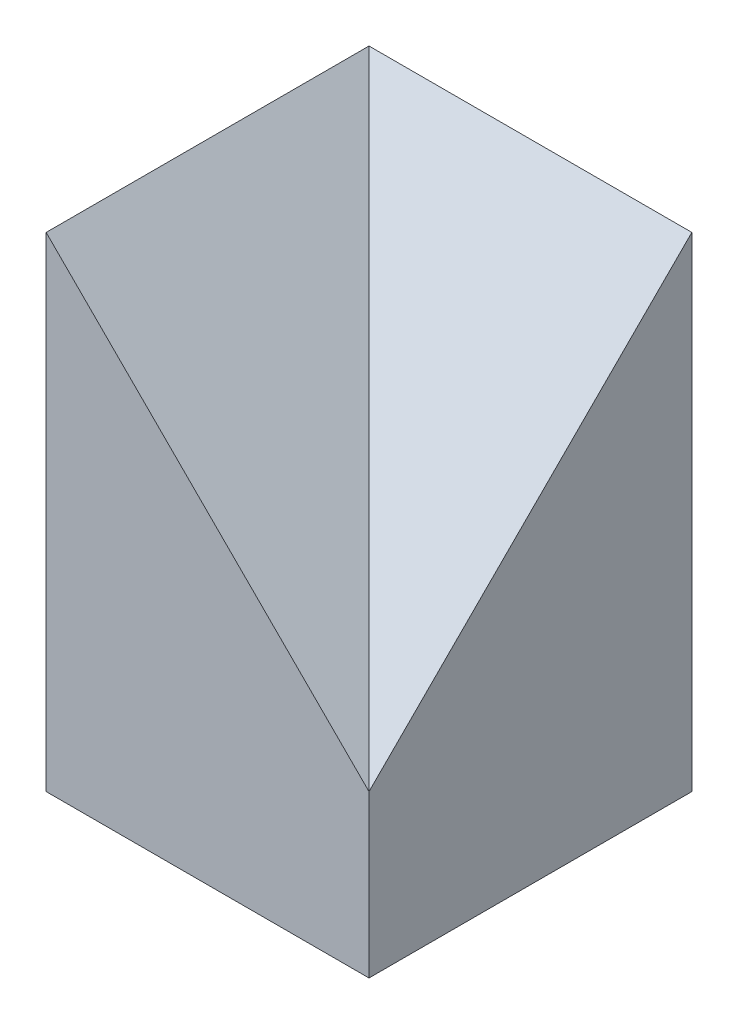
ISO-10303-21;
HEADER;
FILE_DESCRIPTION(('STEP AP214'),'2;1');
FILE_NAME('part.step','',(''),(''),'','','');
FILE_SCHEMA(('AUTOMOTIVE_DESIGN { 1 0 10303 214 1 1 1 1 }'));
ENDSEC;
DATA;
#1=APPLICATION_CONTEXT('core data for automotive mechanical design processes');
#2=APPLICATION_PROTOCOL_DEFINITION('international standard','automotive_design',2000,#1);
#3=PRODUCT_CONTEXT('',#1,'mechanical');
#4=PRODUCT('Part','Part','',(#3));
#5=PRODUCT_RELATED_PRODUCT_CATEGORY('part','',(#4));
#6=PRODUCT_DEFINITION_FORMATION('','',#4);
#7=PRODUCT_DEFINITION_CONTEXT('part definition',#1,'design');
#8=PRODUCT_DEFINITION('design','',#6,#7);
#9=PRODUCT_DEFINITION_SHAPE('','',#8);
#10=(LENGTH_UNIT() NAMED_UNIT(*) SI_UNIT(.MILLI.,.METRE.));
#11=(NAMED_UNIT(*) PLANE_ANGLE_UNIT() SI_UNIT($,.RADIAN.));
#12=(NAMED_UNIT(*) SI_UNIT($,.STERADIAN.) SOLID_ANGLE_UNIT());
#13=UNCERTAINTY_MEASURE_WITH_UNIT(LENGTH_MEASURE(1.E-05),#10,'distance_accuracy_value','');
#14=(GEOMETRIC_REPRESENTATION_CONTEXT(3) GLOBAL_UNCERTAINTY_ASSIGNED_CONTEXT((#13)) GLOBAL_UNIT_ASSIGNED_CONTEXT((#10,
#11,#12)) REPRESENTATION_CONTEXT('',''));
#15=CARTESIAN_POINT('',(0.,0.,0.));
#16=DIRECTION('',(0.,0.,1.));
#17=DIRECTION('',(1.,0.,0.));
#18=AXIS2_PLACEMENT_3D('',#15,#16,#17);
#19=CARTESIAN_POINT('',(0.,200.,0.));
#20=DIRECTION('',(1.,0.,0.));
#21=DIRECTION('',(0.,0.,-1.));
#22=AXIS2_PLACEMENT_3D('',#19,#20,#21);
#23=PLANE('',#22);
#24=DIRECTION('',(0.,0.,1.));
#25=VECTOR('',#24,1.);
#26=CARTESIAN_POINT('',(0.,0.,0.));
#27=LINE('',#26,#25);
#28=CARTESIAN_POINT('',(0.,0.,0.));
#29=VERTEX_POINT('',#28);
#30=CARTESIAN_POINT('',(0.,0.,400.));
#31=VERTEX_POINT('',#30);
#32=EDGE_CURVE('E94',#29,#31,#27,.T.);
#33=ORIENTED_EDGE('',*,*,#32,.T.);
#34=DIRECTION('',(0.,-1.,0.));
#35=VECTOR('',#34,1.);
#36=CARTESIAN_POINT('',(0.,200.,400.));
#37=LINE('',#36,#35);
#38=CARTESIAN_POINT('',(0.,600.,400.));
#39=VERTEX_POINT('',#38);
#40=EDGE_CURVE('E11',#39,#31,#37,.T.);
#41=ORIENTED_EDGE('',*,*,#40,.F.);
#42=DIRECTION('',(0.,0.,1.));
#43=VECTOR('',#42,1.);
#44=CARTESIAN_POINT('',(0.,600.,0.));
#45=LINE('',#44,#43);
#46=CARTESIAN_POINT('',(0.,600.,0.));
#47=VERTEX_POINT('',#46);
#48=EDGE_CURVE('E75',#47,#39,#45,.T.);
#49=ORIENTED_EDGE('',*,*,#48,.F.);
#50=DIRECTION('',(0.,-1.,0.));
#51=VECTOR('',#50,1.);
#52=CARTESIAN_POINT('',(0.,200.,0.));
#53=LINE('',#52,#51);
#54=EDGE_CURVE('E95',#47,#29,#53,.T.);
#55=ORIENTED_EDGE('',*,*,#54,.T.);
#56=EDGE_LOOP('',(#33,#41,#49,#55));
#57=FACE_BOUND('',#56,.T.);
#58=ADVANCED_FACE('F34',(#57),#23,.F.);
#59=CARTESIAN_POINT('',(0.,200.,400.));
#60=DIRECTION('',(0.,0.,-1.));
#61=DIRECTION('',(-1.,0.,0.));
#62=AXIS2_PLACEMENT_3D('',#59,#60,#61);
#63=PLANE('',#62);
#64=DIRECTION('',(0.,-1.,0.));
#65=VECTOR('',#64,1.);
#66=CARTESIAN_POINT('',(400.,200.,400.));
#67=LINE('',#66,#65);
#68=CARTESIAN_POINT('',(400.,200.,400.));
#69=VERTEX_POINT('',#68);
#70=CARTESIAN_POINT('',(400.,0.,400.));
#71=VERTEX_POINT('',#70);
#72=EDGE_CURVE('E41',#69,#71,#67,.T.);
#73=ORIENTED_EDGE('',*,*,#72,.F.);
#74=DIRECTION('',(-0.707106781186548,0.707106781186548,0.));
#75=VECTOR('',#74,1.);
#76=CARTESIAN_POINT('',(200.,400.,400.));
#77=LINE('',#76,#75);
#78=EDGE_CURVE('E78',#69,#39,#77,.T.);
#79=ORIENTED_EDGE('',*,*,#78,.T.);
#80=ORIENTED_EDGE('',*,*,#40,.T.);
#81=DIRECTION('',(1.,0.,0.));
#82=VECTOR('',#81,1.);
#83=CARTESIAN_POINT('',(0.,0.,400.));
#84=LINE('',#83,#82);
#85=EDGE_CURVE('E97',#31,#71,#84,.T.);
#86=ORIENTED_EDGE('',*,*,#85,.T.);
#87=EDGE_LOOP('',(#73,#79,#80,#86));
#88=FACE_BOUND('',#87,.T.);
#89=ADVANCED_FACE('F88',(#88),#63,.F.);
#90=CARTESIAN_POINT('',(400.,200.,0.));
#91=DIRECTION('',(-1.,0.,0.));
#92=DIRECTION('',(0.,0.,1.));
#93=AXIS2_PLACEMENT_3D('',#90,#91,#92);
#94=PLANE('',#93);
#95=DIRECTION('',(0.,-1.,0.));
#96=VECTOR('',#95,1.);
#97=CARTESIAN_POINT('',(400.,200.,0.));
#98=LINE('',#97,#96);
#99=CARTESIAN_POINT('',(400.,600.,0.));
#100=VERTEX_POINT('',#99);
#101=CARTESIAN_POINT('',(400.,0.,0.));
#102=VERTEX_POINT('',#101);
#103=EDGE_CURVE('E105',#100,#102,#98,.T.);
#104=ORIENTED_EDGE('',*,*,#103,.F.);
#105=DIRECTION('',(0.,-0.707106781186548,0.707106781186547));
#106=VECTOR('',#105,1.);
#107=CARTESIAN_POINT('',(400.,400.,200.));
#108=LINE('',#107,#106);
#109=EDGE_CURVE('E91',#100,#69,#108,.T.);
#110=ORIENTED_EDGE('',*,*,#109,.T.);
#111=ORIENTED_EDGE('',*,*,#72,.T.);
#112=DIRECTION('',(0.,0.,-1.));
#113=VECTOR('',#112,1.);
#114=CARTESIAN_POINT('',(400.,0.,0.));
#115=LINE('',#114,#113);
#116=EDGE_CURVE('E56',#71,#102,#115,.T.);
#117=ORIENTED_EDGE('',*,*,#116,.T.);
#118=EDGE_LOOP('',(#104,#110,#111,#117));
#119=FACE_BOUND('',#118,.T.);
#120=ADVANCED_FACE('F107',(#119),#94,.F.);
#121=CARTESIAN_POINT('',(0.,200.,0.));
#122=DIRECTION('',(0.,0.,1.));
#123=DIRECTION('',(1.,0.,0.));
#124=AXIS2_PLACEMENT_3D('',#121,#122,#123);
#125=PLANE('',#124);
#126=DIRECTION('',(-1.,0.,0.));
#127=VECTOR('',#126,1.);
#128=CARTESIAN_POINT('',(0.,0.,0.));
#129=LINE('',#128,#127);
#130=EDGE_CURVE('E48',#102,#29,#129,.T.);
#131=ORIENTED_EDGE('',*,*,#130,.T.);
#132=ORIENTED_EDGE('',*,*,#54,.F.);
#133=DIRECTION('',(-1.,0.,0.));
#134=VECTOR('',#133,1.);
#135=CARTESIAN_POINT('',(0.,600.,0.));
#136=LINE('',#135,#134);
#137=EDGE_CURVE('E84',#100,#47,#136,.T.);
#138=ORIENTED_EDGE('',*,*,#137,.F.);
#139=ORIENTED_EDGE('',*,*,#103,.T.);
#140=EDGE_LOOP('',(#131,#132,#138,#139));
#141=FACE_BOUND('',#140,.T.);
#142=ADVANCED_FACE('F110',(#141),#125,.F.);
#143=CARTESIAN_POINT('',(0.,0.,0.));
#144=DIRECTION('',(0.,1.,0.));
#145=DIRECTION('',(0.,0.,1.));
#146=AXIS2_PLACEMENT_3D('',#143,#144,#145);
#147=PLANE('',#146);
#148=ORIENTED_EDGE('',*,*,#32,.F.);
#149=ORIENTED_EDGE('',*,*,#130,.F.);
#150=ORIENTED_EDGE('',*,*,#116,.F.);
#151=ORIENTED_EDGE('',*,*,#85,.F.);
#152=EDGE_LOOP('',(#148,#149,#150,#151));
#153=FACE_BOUND('',#152,.T.);
#154=ADVANCED_FACE('F108',(#153),#147,.F.);
#155=CARTESIAN_POINT('',(466.666666666667,133.333333333333,466.666666666667));
#156=DIRECTION('',(-0.707106781186548,-0.707106781186548,0.));
#157=DIRECTION('',(0.707106781186548,-0.707106781186548,0.));
#158=AXIS2_PLACEMENT_3D('',#155,#156,#157);
#159=PLANE('',#158);
#160=DIRECTION('',(-0.577350269189626,0.577350269189626,-0.577350269189626));
#161=VECTOR('',#160,1.);
#162=CARTESIAN_POINT('',(466.666666666667,133.333333333333,466.666666666667));
#163=LINE('',#162,#161);
#164=EDGE_CURVE('E80',#69,#47,#163,.T.);
#165=ORIENTED_EDGE('',*,*,#164,.T.);
#166=ORIENTED_EDGE('',*,*,#48,.T.);
#167=ORIENTED_EDGE('',*,*,#78,.F.);
#168=EDGE_LOOP('',(#165,#166,#167));
#169=FACE_BOUND('',#168,.T.);
#170=ADVANCED_FACE('F77',(#169),#159,.F.);
#171=CARTESIAN_POINT('',(466.666666666667,133.333333333333,466.666666666667));
#172=DIRECTION('',(0.,-0.707106781186547,-0.707106781186548));
#173=DIRECTION('',(0.,0.707106781186548,-0.707106781186547));
#174=AXIS2_PLACEMENT_3D('',#171,#172,#173);
#175=PLANE('',#174);
#176=ORIENTED_EDGE('',*,*,#137,.T.);
#177=ORIENTED_EDGE('',*,*,#164,.F.);
#178=ORIENTED_EDGE('',*,*,#109,.F.);
#179=EDGE_LOOP('',(#176,#177,#178));
#180=FACE_BOUND('',#179,.T.);
#181=ADVANCED_FACE('F116',(#180),#175,.F.);
#182=CLOSED_SHELL('',(#58,#89,#120,#142,#154,#170,#181));
#183=MANIFOLD_SOLID_BREP('B2',#182);
#184=ADVANCED_BREP_SHAPE_REPRESENTATION('',(#18,#183),#14);
#185=SHAPE_DEFINITION_REPRESENTATION(#9,#184);
ENDSEC;
END-ISO-10303-21;
